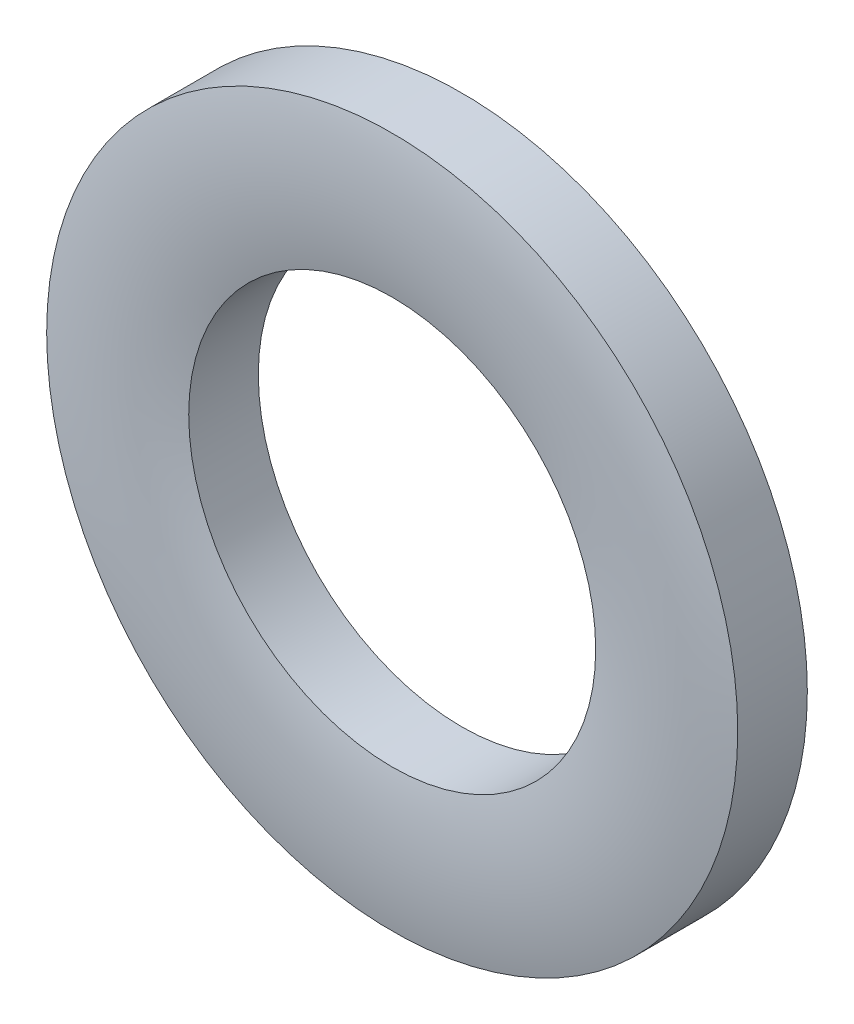
ISO-10303-21;
HEADER;
FILE_DESCRIPTION(('STEP AP214'),'2;1');
FILE_NAME('part.step','',(''),(''),'','','');
FILE_SCHEMA(('AUTOMOTIVE_DESIGN { 1 0 10303 214 1 1 1 1 }'));
ENDSEC;
DATA;
#1=APPLICATION_CONTEXT('core data for automotive mechanical design processes');
#2=APPLICATION_PROTOCOL_DEFINITION('international standard','automotive_design',2000,#1);
#3=PRODUCT_CONTEXT('',#1,'mechanical');
#4=PRODUCT('Part','Part','',(#3));
#5=PRODUCT_RELATED_PRODUCT_CATEGORY('part','',(#4));
#6=PRODUCT_DEFINITION_FORMATION('','',#4);
#7=PRODUCT_DEFINITION_CONTEXT('part definition',#1,'design');
#8=PRODUCT_DEFINITION('design','',#6,#7);
#9=PRODUCT_DEFINITION_SHAPE('','',#8);
#10=(LENGTH_UNIT() NAMED_UNIT(*) SI_UNIT(.MILLI.,.METRE.));
#11=(NAMED_UNIT(*) PLANE_ANGLE_UNIT() SI_UNIT($,.RADIAN.));
#12=(NAMED_UNIT(*) SI_UNIT($,.STERADIAN.) SOLID_ANGLE_UNIT());
#13=UNCERTAINTY_MEASURE_WITH_UNIT(LENGTH_MEASURE(1.E-05),#10,'distance_accuracy_value','');
#14=(GEOMETRIC_REPRESENTATION_CONTEXT(3) GLOBAL_UNCERTAINTY_ASSIGNED_CONTEXT((#13)) GLOBAL_UNIT_ASSIGNED_CONTEXT((#10,
#11,#12)) REPRESENTATION_CONTEXT('',''));
#15=CARTESIAN_POINT('',(0.,0.,0.));
#16=DIRECTION('',(0.,0.,1.));
#17=DIRECTION('',(1.,0.,0.));
#18=AXIS2_PLACEMENT_3D('',#15,#16,#17);
#19=CARTESIAN_POINT('',(0.,2.65,-0.5));
#20=DIRECTION('',(0.,0.,1.));
#21=DIRECTION('',(1.,0.,0.));
#22=AXIS2_PLACEMENT_3D('',#19,#20,#21);
#23=PLANE('',#22);
#24=CARTESIAN_POINT('',(0.,0.,-0.5));
#25=DIRECTION('',(0.,0.,1.));
#26=DIRECTION('',(1.,0.,0.));
#27=AXIS2_PLACEMENT_3D('',#24,#25,#26);
#28=CIRCLE('',#27,4.5);
#29=CARTESIAN_POINT('',(4.5,0.,-0.5));
#30=VERTEX_POINT('',#29);
#31=EDGE_CURVE('E52',#30,#30,#28,.T.);
#32=ORIENTED_EDGE('',*,*,#31,.F.);
#33=EDGE_LOOP('',(#32));
#34=FACE_BOUND('',#33,.T.);
#35=CARTESIAN_POINT('',(0.,0.,-0.5));
#36=DIRECTION('',(0.,0.,1.));
#37=DIRECTION('',(1.,0.,0.));
#38=AXIS2_PLACEMENT_3D('',#35,#36,#37);
#39=CIRCLE('',#38,2.65);
#40=CARTESIAN_POINT('',(2.65,0.,-0.5));
#41=VERTEX_POINT('',#40);
#42=EDGE_CURVE('E10',#41,#41,#39,.T.);
#43=ORIENTED_EDGE('',*,*,#42,.T.);
#44=EDGE_LOOP('',(#43));
#45=FACE_BOUND('',#44,.T.);
#46=ADVANCED_FACE('F34',(#34,#45),#23,.F.);
#47=CARTESIAN_POINT('',(0.,0.,0.5));
#48=DIRECTION('',(0.,0.,1.));
#49=DIRECTION('',(1.,0.,0.));
#50=AXIS2_PLACEMENT_3D('',#47,#48,#49);
#51=CYLINDRICAL_SURFACE('',#50,2.65);
#52=ORIENTED_EDGE('',*,*,#42,.F.);
#53=EDGE_LOOP('',(#52));
#54=FACE_BOUND('',#53,.T.);
#55=CARTESIAN_POINT('',(0.,0.,0.4063));
#56=DIRECTION('',(0.,0.,1.));
#57=DIRECTION('',(1.,0.,0.));
#58=AXIS2_PLACEMENT_3D('',#55,#56,#57);
#59=CIRCLE('',#58,2.65);
#60=CARTESIAN_POINT('',(2.65,0.,0.4063));
#61=VERTEX_POINT('',#60);
#62=EDGE_CURVE('E41',#61,#61,#59,.T.);
#63=ORIENTED_EDGE('',*,*,#62,.T.);
#64=EDGE_LOOP('',(#63));
#65=FACE_BOUND('',#64,.T.);
#66=ADVANCED_FACE('F61',(#54,#65),#51,.F.);
#67=CARTESIAN_POINT('',(0.,0.,-4.11261840981858));
#68=DIRECTION('',(0.,0.,1.));
#69=DIRECTION('',(1.,0.,0.));
#70=AXIS2_PLACEMENT_3D('',#67,#68,#69);
#71=DEGENERATE_TOROIDAL_SURFACE('',#70,3.575,4.61261840981858,.T.);
#72=ORIENTED_EDGE('',*,*,#62,.F.);
#73=EDGE_LOOP('',(#72));
#74=FACE_BOUND('',#73,.T.);
#75=CARTESIAN_POINT('',(0.,0.,0.4063));
#76=DIRECTION('',(0.,0.,1.));
#77=DIRECTION('',(1.,0.,0.));
#78=AXIS2_PLACEMENT_3D('',#75,#76,#77);
#79=CIRCLE('',#78,4.5);
#80=CARTESIAN_POINT('',(4.5,0.,0.4063));
#81=VERTEX_POINT('',#80);
#82=EDGE_CURVE('E47',#81,#81,#79,.T.);
#83=ORIENTED_EDGE('',*,*,#82,.T.);
#84=EDGE_LOOP('',(#83));
#85=FACE_BOUND('',#84,.T.);
#86=ADVANCED_FACE('F65',(#74,#85),#71,.T.);
#87=CARTESIAN_POINT('',(0.,0.,0.5));
#88=DIRECTION('',(0.,0.,1.));
#89=DIRECTION('',(1.,0.,0.));
#90=AXIS2_PLACEMENT_3D('',#87,#88,#89);
#91=CYLINDRICAL_SURFACE('',#90,4.5);
#92=ORIENTED_EDGE('',*,*,#82,.F.);
#93=EDGE_LOOP('',(#92));
#94=FACE_BOUND('',#93,.T.);
#95=ORIENTED_EDGE('',*,*,#31,.T.);
#96=EDGE_LOOP('',(#95));
#97=FACE_BOUND('',#96,.T.);
#98=ADVANCED_FACE('F58',(#94,#97),#91,.T.);
#99=CLOSED_SHELL('',(#46,#66,#86,#98));
#100=MANIFOLD_SOLID_BREP('B2',#99);
#101=ADVANCED_BREP_SHAPE_REPRESENTATION('',(#18,#100),#14);
#102=SHAPE_DEFINITION_REPRESENTATION(#9,#101);
ENDSEC;
END-ISO-10303-21;
